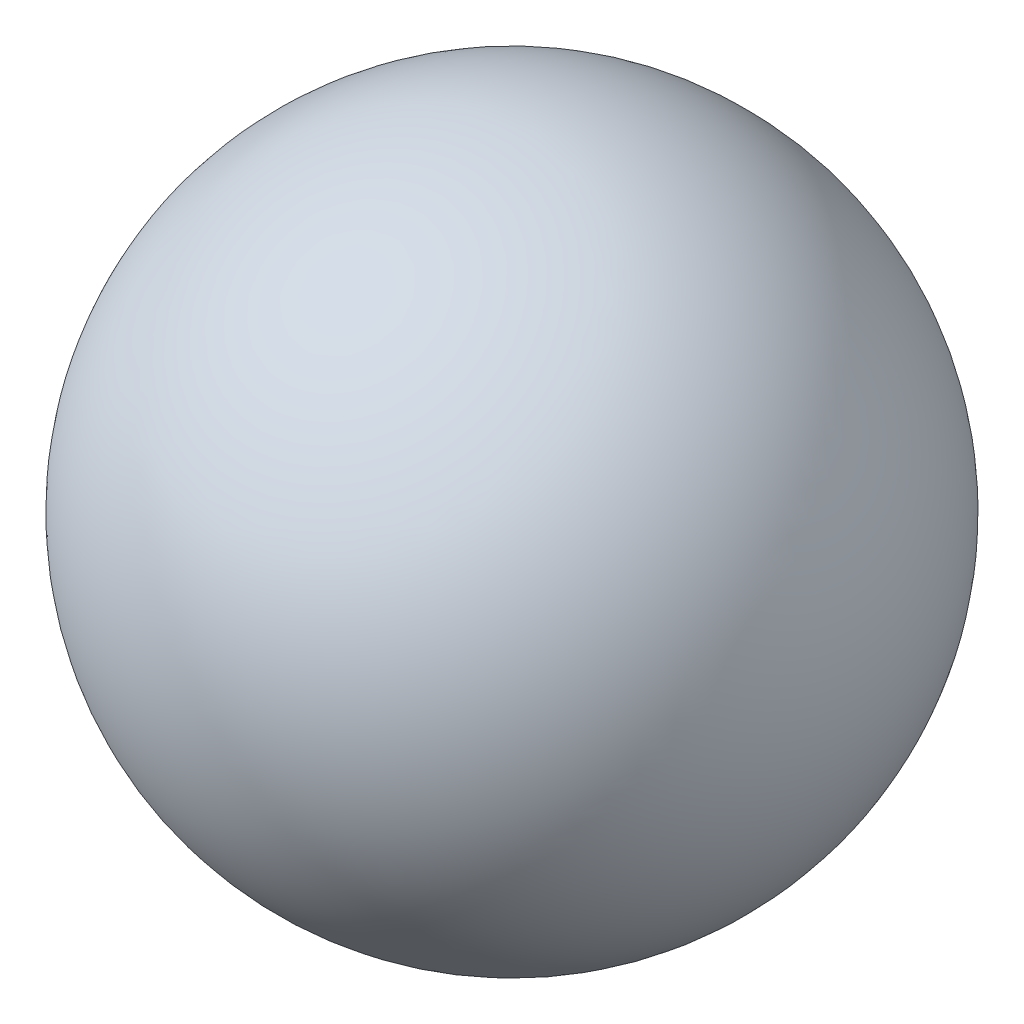
ISO-10303-21;
HEADER;
FILE_DESCRIPTION(('STEP AP214'),'2;1');
FILE_NAME('part.step','',(''),(''),'','','');
FILE_SCHEMA(('AUTOMOTIVE_DESIGN { 1 0 10303 214 1 1 1 1 }'));
ENDSEC;
DATA;
#1=APPLICATION_CONTEXT('core data for automotive mechanical design processes');
#2=APPLICATION_PROTOCOL_DEFINITION('international standard','automotive_design',2000,#1);
#3=PRODUCT_CONTEXT('',#1,'mechanical');
#4=PRODUCT('Part','Part','',(#3));
#5=PRODUCT_RELATED_PRODUCT_CATEGORY('part','',(#4));
#6=PRODUCT_DEFINITION_FORMATION('','',#4);
#7=PRODUCT_DEFINITION_CONTEXT('part definition',#1,'design');
#8=PRODUCT_DEFINITION('design','',#6,#7);
#9=PRODUCT_DEFINITION_SHAPE('','',#8);
#10=(LENGTH_UNIT() NAMED_UNIT(*) SI_UNIT(.MILLI.,.METRE.));
#11=(NAMED_UNIT(*) PLANE_ANGLE_UNIT() SI_UNIT($,.RADIAN.));
#12=(NAMED_UNIT(*) SI_UNIT($,.STERADIAN.) SOLID_ANGLE_UNIT());
#13=UNCERTAINTY_MEASURE_WITH_UNIT(LENGTH_MEASURE(1.E-05),#10,'distance_accuracy_value','');
#14=(GEOMETRIC_REPRESENTATION_CONTEXT(3) GLOBAL_UNCERTAINTY_ASSIGNED_CONTEXT((#13)) GLOBAL_UNIT_ASSIGNED_CONTEXT((#10,
#11,#12)) REPRESENTATION_CONTEXT('',''));
#15=CARTESIAN_POINT('',(0.,0.,0.));
#16=DIRECTION('',(0.,0.,1.));
#17=DIRECTION('',(1.,0.,0.));
#18=AXIS2_PLACEMENT_3D('',#15,#16,#17);
#19=CARTESIAN_POINT('',(0.,0.,0.));
#20=DIRECTION('',(-1.,0.,0.));
#21=DIRECTION('',(0.,1.,0.));
#22=AXIS2_PLACEMENT_3D('',#19,#20,#21);
#23=SPHERICAL_SURFACE('',#22,40.);
#24=CARTESIAN_POINT('',(-40.,0.,0.));
#25=VERTEX_POINT('',#24);
#26=VERTEX_LOOP('',#25);
#27=FACE_BOUND('',#26,.T.);
#28=ADVANCED_FACE('F41',(#27),#23,.T.);
#29=CLOSED_SHELL('',(#28));
#30=MANIFOLD_SOLID_BREP('B2',#29);
#31=ADVANCED_BREP_SHAPE_REPRESENTATION('',(#18,#30),#14);
#32=SHAPE_DEFINITION_REPRESENTATION(#9,#31);
ENDSEC;
END-ISO-10303-21;
